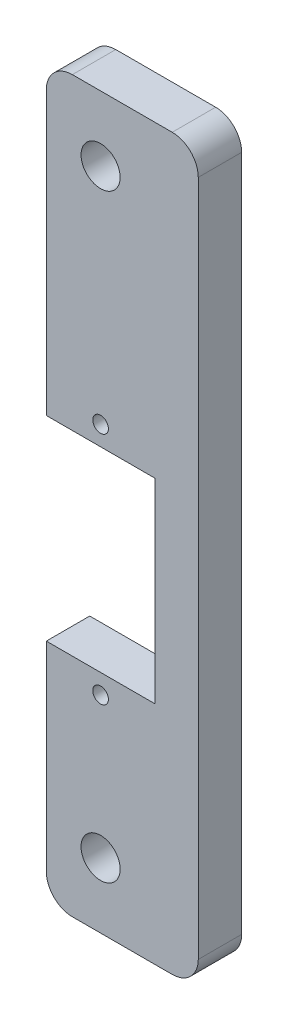
ISO-10303-21;
HEADER;
FILE_DESCRIPTION(('STEP AP214'),'2;1');
FILE_NAME('part.step','',(''),(''),'','','');
FILE_SCHEMA(('AUTOMOTIVE_DESIGN { 1 0 10303 214 1 1 1 1 }'));
ENDSEC;
DATA;
#1=APPLICATION_CONTEXT('core data for automotive mechanical design processes');
#2=APPLICATION_PROTOCOL_DEFINITION('international standard','automotive_design',2000,#1);
#3=PRODUCT_CONTEXT('',#1,'mechanical');
#4=PRODUCT('Part','Part','',(#3));
#5=PRODUCT_RELATED_PRODUCT_CATEGORY('part','',(#4));
#6=PRODUCT_DEFINITION_FORMATION('','',#4);
#7=PRODUCT_DEFINITION_CONTEXT('part definition',#1,'design');
#8=PRODUCT_DEFINITION('design','',#6,#7);
#9=PRODUCT_DEFINITION_SHAPE('','',#8);
#10=(LENGTH_UNIT() NAMED_UNIT(*) SI_UNIT(.MILLI.,.METRE.));
#11=(NAMED_UNIT(*) PLANE_ANGLE_UNIT() SI_UNIT($,.RADIAN.));
#12=(NAMED_UNIT(*) SI_UNIT($,.STERADIAN.) SOLID_ANGLE_UNIT());
#13=UNCERTAINTY_MEASURE_WITH_UNIT(LENGTH_MEASURE(1.E-05),#10,'distance_accuracy_value','');
#14=(GEOMETRIC_REPRESENTATION_CONTEXT(3) GLOBAL_UNCERTAINTY_ASSIGNED_CONTEXT((#13)) GLOBAL_UNIT_ASSIGNED_CONTEXT((#10,
#11,#12)) REPRESENTATION_CONTEXT('',''));
#15=CARTESIAN_POINT('',(0.,0.,0.));
#16=DIRECTION('',(0.,0.,1.));
#17=DIRECTION('',(1.,0.,0.));
#18=AXIS2_PLACEMENT_3D('',#15,#16,#17);
#19=CARTESIAN_POINT('',(-6.25,0.,5.));
#20=DIRECTION('',(-1.,0.,0.));
#21=DIRECTION('',(0.,0.,1.));
#22=AXIS2_PLACEMENT_3D('',#19,#20,#21);
#23=PLANE('',#22);
#24=DIRECTION('',(0.,1.,0.));
#25=VECTOR('',#24,1.);
#26=CARTESIAN_POINT('',(-6.25,0.,5.));
#27=LINE('',#26,#25);
#28=CARTESIAN_POINT('',(-6.25,11.25,5.));
#29=VERTEX_POINT('',#28);
#30=CARTESIAN_POINT('',(-6.25,43.75,5.));
#31=VERTEX_POINT('',#30);
#32=EDGE_CURVE('E127',#29,#31,#27,.T.);
#33=ORIENTED_EDGE('',*,*,#32,.T.);
#34=DIRECTION('',(0.,0.,-1.));
#35=VECTOR('',#34,1.);
#36=CARTESIAN_POINT('',(-6.25,43.75,5.));
#37=LINE('',#36,#35);
#38=CARTESIAN_POINT('',(-6.25,43.75,0.));
#39=VERTEX_POINT('',#38);
#40=EDGE_CURVE('E212',#31,#39,#37,.T.);
#41=ORIENTED_EDGE('',*,*,#40,.T.);
#42=DIRECTION('',(0.,1.,0.));
#43=VECTOR('',#42,1.);
#44=CARTESIAN_POINT('',(-6.25,0.,0.));
#45=LINE('',#44,#43);
#46=CARTESIAN_POINT('',(-6.25,11.25,0.));
#47=VERTEX_POINT('',#46);
#48=EDGE_CURVE('E130',#47,#39,#45,.T.);
#49=ORIENTED_EDGE('',*,*,#48,.F.);
#50=DIRECTION('',(0.,0.,-1.));
#51=VECTOR('',#50,1.);
#52=CARTESIAN_POINT('',(-6.25,11.25,5.));
#53=LINE('',#52,#51);
#54=EDGE_CURVE('E123',#29,#47,#53,.T.);
#55=ORIENTED_EDGE('',*,*,#54,.F.);
#56=EDGE_LOOP('',(#33,#41,#49,#55));
#57=FACE_BOUND('',#56,.T.);
#58=ADVANCED_FACE('F33',(#57),#23,.T.);
#59=CARTESIAN_POINT('',(0.,11.25,5.));
#60=DIRECTION('',(0.,1.,0.));
#61=DIRECTION('',(0.,0.,1.));
#62=AXIS2_PLACEMENT_3D('',#59,#60,#61);
#63=PLANE('',#62);
#64=DIRECTION('',(1.,0.,0.));
#65=VECTOR('',#64,1.);
#66=CARTESIAN_POINT('',(0.,11.25,0.));
#67=LINE('',#66,#65);
#68=CARTESIAN_POINT('',(6.25,11.25,0.));
#69=VERTEX_POINT('',#68);
#70=EDGE_CURVE('E172',#47,#69,#67,.T.);
#71=ORIENTED_EDGE('',*,*,#70,.T.);
#72=DIRECTION('',(0.,0.,-1.));
#73=VECTOR('',#72,1.);
#74=CARTESIAN_POINT('',(6.25,11.25,5.));
#75=LINE('',#74,#73);
#76=CARTESIAN_POINT('',(6.25,11.25,5.));
#77=VERTEX_POINT('',#76);
#78=EDGE_CURVE('E134',#77,#69,#75,.T.);
#79=ORIENTED_EDGE('',*,*,#78,.F.);
#80=DIRECTION('',(1.,0.,0.));
#81=VECTOR('',#80,1.);
#82=CARTESIAN_POINT('',(0.,11.25,5.));
#83=LINE('',#82,#81);
#84=EDGE_CURVE('E137',#29,#77,#83,.T.);
#85=ORIENTED_EDGE('',*,*,#84,.F.);
#86=ORIENTED_EDGE('',*,*,#54,.T.);
#87=EDGE_LOOP('',(#71,#79,#85,#86));
#88=FACE_BOUND('',#87,.T.);
#89=ADVANCED_FACE('F138',(#88),#63,.F.);
#90=CARTESIAN_POINT('',(6.25,0.,5.));
#91=DIRECTION('',(1.,0.,0.));
#92=DIRECTION('',(0.,0.,-1.));
#93=AXIS2_PLACEMENT_3D('',#90,#91,#92);
#94=PLANE('',#93);
#95=DIRECTION('',(0.,-1.,0.));
#96=VECTOR('',#95,1.);
#97=CARTESIAN_POINT('',(6.25,0.,0.));
#98=LINE('',#97,#96);
#99=CARTESIAN_POINT('',(6.25,-11.25,0.));
#100=VERTEX_POINT('',#99);
#101=EDGE_CURVE('E174',#69,#100,#98,.T.);
#102=ORIENTED_EDGE('',*,*,#101,.T.);
#103=DIRECTION('',(0.,0.,-1.));
#104=VECTOR('',#103,1.);
#105=CARTESIAN_POINT('',(6.25,-11.25,5.));
#106=LINE('',#105,#104);
#107=CARTESIAN_POINT('',(6.25,-11.25,5.));
#108=VERTEX_POINT('',#107);
#109=EDGE_CURVE('E189',#108,#100,#106,.T.);
#110=ORIENTED_EDGE('',*,*,#109,.F.);
#111=DIRECTION('',(0.,-1.,0.));
#112=VECTOR('',#111,1.);
#113=CARTESIAN_POINT('',(6.25,0.,5.));
#114=LINE('',#113,#112);
#115=EDGE_CURVE('E141',#77,#108,#114,.T.);
#116=ORIENTED_EDGE('',*,*,#115,.F.);
#117=ORIENTED_EDGE('',*,*,#78,.T.);
#118=EDGE_LOOP('',(#102,#110,#116,#117));
#119=FACE_BOUND('',#118,.T.);
#120=ADVANCED_FACE('F236',(#119),#94,.F.);
#121=CARTESIAN_POINT('',(0.,-11.25,5.));
#122=DIRECTION('',(0.,1.,0.));
#123=DIRECTION('',(0.,0.,1.));
#124=AXIS2_PLACEMENT_3D('',#121,#122,#123);
#125=PLANE('',#124);
#126=DIRECTION('',(1.,0.,0.));
#127=VECTOR('',#126,1.);
#128=CARTESIAN_POINT('',(0.,-11.25,0.));
#129=LINE('',#128,#127);
#130=CARTESIAN_POINT('',(-6.25,-11.25,0.));
#131=VERTEX_POINT('',#130);
#132=EDGE_CURVE('E177',#131,#100,#129,.T.);
#133=ORIENTED_EDGE('',*,*,#132,.F.);
#134=DIRECTION('',(0.,0.,-1.));
#135=VECTOR('',#134,1.);
#136=CARTESIAN_POINT('',(-6.25,-11.25,5.));
#137=LINE('',#136,#135);
#138=CARTESIAN_POINT('',(-6.25,-11.25,5.));
#139=VERTEX_POINT('',#138);
#140=EDGE_CURVE('E170',#139,#131,#137,.T.);
#141=ORIENTED_EDGE('',*,*,#140,.F.);
#142=DIRECTION('',(1.,0.,0.));
#143=VECTOR('',#142,1.);
#144=CARTESIAN_POINT('',(0.,-11.25,5.));
#145=LINE('',#144,#143);
#146=EDGE_CURVE('E157',#139,#108,#145,.T.);
#147=ORIENTED_EDGE('',*,*,#146,.T.);
#148=ORIENTED_EDGE('',*,*,#109,.T.);
#149=EDGE_LOOP('',(#133,#141,#147,#148));
#150=FACE_BOUND('',#149,.T.);
#151=ADVANCED_FACE('F243',(#150),#125,.T.);
#152=CARTESIAN_POINT('',(-6.25,0.,5.));
#153=DIRECTION('',(-1.,0.,0.));
#154=DIRECTION('',(0.,-1.,0.));
#155=AXIS2_PLACEMENT_3D('',#152,#153,#154);
#156=PLANE('',#155);
#157=DIRECTION('',(0.,1.,0.));
#158=VECTOR('',#157,1.);
#159=CARTESIAN_POINT('',(-6.25,0.,0.));
#160=LINE('',#159,#158);
#161=CARTESIAN_POINT('',(-6.25,-34.25,0.));
#162=VERTEX_POINT('',#161);
#163=EDGE_CURVE('E180',#162,#131,#160,.T.);
#164=ORIENTED_EDGE('',*,*,#163,.F.);
#165=DIRECTION('',(0.,0.,-1.));
#166=VECTOR('',#165,1.);
#167=CARTESIAN_POINT('',(-6.25,-34.25,5.));
#168=LINE('',#167,#166);
#169=CARTESIAN_POINT('',(-6.25,-34.25,5.));
#170=VERTEX_POINT('',#169);
#171=EDGE_CURVE('E204',#162,#170,#168,.F.);
#172=ORIENTED_EDGE('',*,*,#171,.T.);
#173=DIRECTION('',(0.,1.,0.));
#174=VECTOR('',#173,1.);
#175=CARTESIAN_POINT('',(-6.25,0.,5.));
#176=LINE('',#175,#174);
#177=EDGE_CURVE('E160',#170,#139,#176,.T.);
#178=ORIENTED_EDGE('',*,*,#177,.T.);
#179=ORIENTED_EDGE('',*,*,#140,.T.);
#180=EDGE_LOOP('',(#164,#172,#178,#179));
#181=FACE_BOUND('',#180,.T.);
#182=ADVANCED_FACE('F246',(#181),#156,.T.);
#183=CARTESIAN_POINT('',(0.,-37.25,5.));
#184=DIRECTION('',(0.,1.,0.));
#185=DIRECTION('',(0.,0.,1.));
#186=AXIS2_PLACEMENT_3D('',#183,#184,#185);
#187=PLANE('',#186);
#188=DIRECTION('',(1.,0.,0.));
#189=VECTOR('',#188,1.);
#190=CARTESIAN_POINT('',(0.,-37.25,5.));
#191=LINE('',#190,#189);
#192=CARTESIAN_POINT('',(-3.25,-37.25,5.));
#193=VERTEX_POINT('',#192);
#194=CARTESIAN_POINT('',(8.25000000000001,-37.25,5.));
#195=VERTEX_POINT('',#194);
#196=EDGE_CURVE('E162',#193,#195,#191,.T.);
#197=ORIENTED_EDGE('',*,*,#196,.F.);
#198=DIRECTION('',(0.,0.,-1.));
#199=VECTOR('',#198,1.);
#200=CARTESIAN_POINT('',(-3.25,-37.25,0.));
#201=LINE('',#200,#199);
#202=CARTESIAN_POINT('',(-3.25,-37.25,0.));
#203=VERTEX_POINT('',#202);
#204=EDGE_CURVE('E193',#193,#203,#201,.T.);
#205=ORIENTED_EDGE('',*,*,#204,.T.);
#206=DIRECTION('',(1.,0.,0.));
#207=VECTOR('',#206,1.);
#208=CARTESIAN_POINT('',(0.,-37.25,0.));
#209=LINE('',#208,#207);
#210=CARTESIAN_POINT('',(8.25000000000001,-37.25,0.));
#211=VERTEX_POINT('',#210);
#212=EDGE_CURVE('E182',#203,#211,#209,.T.);
#213=ORIENTED_EDGE('',*,*,#212,.T.);
#214=DIRECTION('',(0.,0.,-1.));
#215=VECTOR('',#214,1.);
#216=CARTESIAN_POINT('',(8.25000000000001,-37.25,5.));
#217=LINE('',#216,#215);
#218=EDGE_CURVE('E133',#211,#195,#217,.F.);
#219=ORIENTED_EDGE('',*,*,#218,.T.);
#220=EDGE_LOOP('',(#197,#205,#213,#219));
#221=FACE_BOUND('',#220,.T.);
#222=ADVANCED_FACE('F253',(#221),#187,.F.);
#223=CARTESIAN_POINT('',(11.25,0.,5.));
#224=DIRECTION('',(1.,0.,0.));
#225=DIRECTION('',(0.,0.,-1.));
#226=AXIS2_PLACEMENT_3D('',#223,#224,#225);
#227=PLANE('',#226);
#228=DIRECTION('',(0.,-1.,0.));
#229=VECTOR('',#228,1.);
#230=CARTESIAN_POINT('',(11.25,0.,0.));
#231=LINE('',#230,#229);
#232=CARTESIAN_POINT('',(11.25,43.75,0.));
#233=VERTEX_POINT('',#232);
#234=CARTESIAN_POINT('',(11.25,-34.25,0.));
#235=VERTEX_POINT('',#234);
#236=EDGE_CURVE('E150',#233,#235,#231,.T.);
#237=ORIENTED_EDGE('',*,*,#236,.F.);
#238=DIRECTION('',(0.,0.,-1.));
#239=VECTOR('',#238,1.);
#240=CARTESIAN_POINT('',(11.25,43.75,5.));
#241=LINE('',#240,#239);
#242=CARTESIAN_POINT('',(11.25,43.75,5.));
#243=VERTEX_POINT('',#242);
#244=EDGE_CURVE('E11',#233,#243,#241,.F.);
#245=ORIENTED_EDGE('',*,*,#244,.T.);
#246=DIRECTION('',(0.,-1.,0.));
#247=VECTOR('',#246,1.);
#248=CARTESIAN_POINT('',(11.25,0.,5.));
#249=LINE('',#248,#247);
#250=CARTESIAN_POINT('',(11.25,-34.25,5.));
#251=VERTEX_POINT('',#250);
#252=EDGE_CURVE('E165',#243,#251,#249,.T.);
#253=ORIENTED_EDGE('',*,*,#252,.T.);
#254=DIRECTION('',(0.,0.,-1.));
#255=VECTOR('',#254,1.);
#256=CARTESIAN_POINT('',(11.25,-34.25,0.));
#257=LINE('',#256,#255);
#258=EDGE_CURVE('E41',#251,#235,#257,.T.);
#259=ORIENTED_EDGE('',*,*,#258,.T.);
#260=EDGE_LOOP('',(#237,#245,#253,#259));
#261=FACE_BOUND('',#260,.T.);
#262=ADVANCED_FACE('F221',(#261),#227,.T.);
#263=CARTESIAN_POINT('',(0.,46.75,5.));
#264=DIRECTION('',(0.,1.,0.));
#265=DIRECTION('',(0.,0.,1.));
#266=AXIS2_PLACEMENT_3D('',#263,#264,#265);
#267=PLANE('',#266);
#268=DIRECTION('',(1.,0.,0.));
#269=VECTOR('',#268,1.);
#270=CARTESIAN_POINT('',(0.,46.75,0.));
#271=LINE('',#270,#269);
#272=CARTESIAN_POINT('',(-3.25,46.75,0.));
#273=VERTEX_POINT('',#272);
#274=CARTESIAN_POINT('',(8.25000000000001,46.75,0.));
#275=VERTEX_POINT('',#274);
#276=EDGE_CURVE('E147',#273,#275,#271,.T.);
#277=ORIENTED_EDGE('',*,*,#276,.F.);
#278=DIRECTION('',(0.,0.,-1.));
#279=VECTOR('',#278,1.);
#280=CARTESIAN_POINT('',(-3.25,46.75,5.));
#281=LINE('',#280,#279);
#282=CARTESIAN_POINT('',(-3.25,46.75,5.));
#283=VERTEX_POINT('',#282);
#284=EDGE_CURVE('E55',#273,#283,#281,.F.);
#285=ORIENTED_EDGE('',*,*,#284,.T.);
#286=DIRECTION('',(1.,0.,0.));
#287=VECTOR('',#286,1.);
#288=CARTESIAN_POINT('',(0.,46.75,5.));
#289=LINE('',#288,#287);
#290=CARTESIAN_POINT('',(8.25000000000001,46.75,5.));
#291=VERTEX_POINT('',#290);
#292=EDGE_CURVE('E168',#283,#291,#289,.T.);
#293=ORIENTED_EDGE('',*,*,#292,.T.);
#294=DIRECTION('',(0.,0.,-1.));
#295=VECTOR('',#294,1.);
#296=CARTESIAN_POINT('',(8.25000000000001,46.75,5.));
#297=LINE('',#296,#295);
#298=EDGE_CURVE('E214',#291,#275,#297,.T.);
#299=ORIENTED_EDGE('',*,*,#298,.T.);
#300=EDGE_LOOP('',(#277,#285,#293,#299));
#301=FACE_BOUND('',#300,.T.);
#302=ADVANCED_FACE('F231',(#301),#267,.T.);
#303=CARTESIAN_POINT('',(0.,0.,5.));
#304=DIRECTION('',(0.,0.,1.));
#305=DIRECTION('',(1.,0.,0.));
#306=AXIS2_PLACEMENT_3D('',#303,#304,#305);
#307=PLANE('',#306);
#308=CARTESIAN_POINT('',(0.,13.5,5.));
#309=DIRECTION('',(0.,0.,-1.));
#310=DIRECTION('',(-1.,0.,0.));
#311=AXIS2_PLACEMENT_3D('',#308,#309,#310);
#312=CIRCLE('',#311,0.899999999999999);
#313=CARTESIAN_POINT('',(-0.9,13.5,5.));
#314=VERTEX_POINT('',#313);
#315=EDGE_CURVE('E429',#314,#314,#312,.T.);
#316=ORIENTED_EDGE('',*,*,#315,.T.);
#317=EDGE_LOOP('',(#316));
#318=FACE_BOUND('',#317,.T.);
#319=CARTESIAN_POINT('',(0.,-13.5,5.));
#320=DIRECTION('',(0.,0.,-1.));
#321=DIRECTION('',(-1.,0.,0.));
#322=AXIS2_PLACEMENT_3D('',#319,#320,#321);
#323=CIRCLE('',#322,0.899999999999999);
#324=CARTESIAN_POINT('',(-0.899999999999998,-13.5,5.));
#325=VERTEX_POINT('',#324);
#326=EDGE_CURVE('E423',#325,#325,#323,.T.);
#327=ORIENTED_EDGE('',*,*,#326,.T.);
#328=EDGE_LOOP('',(#327));
#329=FACE_BOUND('',#328,.T.);
#330=CARTESIAN_POINT('',(0.,39.25,5.));
#331=DIRECTION('',(0.,0.,-1.));
#332=DIRECTION('',(-1.,0.,0.));
#333=AXIS2_PLACEMENT_3D('',#330,#331,#332);
#334=CIRCLE('',#333,2.25);
#335=CARTESIAN_POINT('',(-2.25,39.25,5.));
#336=VERTEX_POINT('',#335);
#337=EDGE_CURVE('E416',#336,#336,#334,.T.);
#338=ORIENTED_EDGE('',*,*,#337,.T.);
#339=EDGE_LOOP('',(#338));
#340=FACE_BOUND('',#339,.T.);
#341=CARTESIAN_POINT('',(0.,-29.75,5.));
#342=DIRECTION('',(0.,0.,-1.));
#343=DIRECTION('',(-1.,0.,0.));
#344=AXIS2_PLACEMENT_3D('',#341,#342,#343);
#345=CIRCLE('',#344,2.25);
#346=CARTESIAN_POINT('',(-2.25,-29.75,5.));
#347=VERTEX_POINT('',#346);
#348=EDGE_CURVE('E153',#347,#347,#345,.T.);
#349=ORIENTED_EDGE('',*,*,#348,.T.);
#350=EDGE_LOOP('',(#349));
#351=FACE_BOUND('',#350,.T.);
#352=ORIENTED_EDGE('',*,*,#177,.F.);
#353=CARTESIAN_POINT('',(-3.25,-34.25,5.));
#354=DIRECTION('',(0.,0.,1.));
#355=DIRECTION('',(1.,0.,0.));
#356=AXIS2_PLACEMENT_3D('',#353,#354,#355);
#357=CIRCLE('',#356,3.);
#358=EDGE_CURVE('E210',#170,#193,#357,.T.);
#359=ORIENTED_EDGE('',*,*,#358,.T.);
#360=ORIENTED_EDGE('',*,*,#196,.T.);
#361=CARTESIAN_POINT('',(8.25000000000001,-34.25,5.));
#362=DIRECTION('',(0.,0.,1.));
#363=DIRECTION('',(1.,0.,0.));
#364=AXIS2_PLACEMENT_3D('',#361,#362,#363);
#365=CIRCLE('',#364,3.);
#366=EDGE_CURVE('E206',#195,#251,#365,.T.);
#367=ORIENTED_EDGE('',*,*,#366,.T.);
#368=ORIENTED_EDGE('',*,*,#252,.F.);
#369=CARTESIAN_POINT('',(8.25000000000001,43.75,5.));
#370=DIRECTION('',(0.,0.,1.));
#371=DIRECTION('',(1.,0.,0.));
#372=AXIS2_PLACEMENT_3D('',#369,#370,#371);
#373=CIRCLE('',#372,3.);
#374=EDGE_CURVE('E48',#243,#291,#373,.T.);
#375=ORIENTED_EDGE('',*,*,#374,.T.);
#376=ORIENTED_EDGE('',*,*,#292,.F.);
#377=CARTESIAN_POINT('',(-3.25,43.75,5.));
#378=DIRECTION('',(0.,0.,1.));
#379=DIRECTION('',(1.,0.,0.));
#380=AXIS2_PLACEMENT_3D('',#377,#378,#379);
#381=CIRCLE('',#380,3.);
#382=EDGE_CURVE('E146',#283,#31,#381,.T.);
#383=ORIENTED_EDGE('',*,*,#382,.T.);
#384=ORIENTED_EDGE('',*,*,#32,.F.);
#385=ORIENTED_EDGE('',*,*,#84,.T.);
#386=ORIENTED_EDGE('',*,*,#115,.T.);
#387=ORIENTED_EDGE('',*,*,#146,.F.);
#388=EDGE_LOOP('',(#352,#359,#360,#367,#368,#375,#376,#383,#384,#385,#386,#387));
#389=FACE_BOUND('',#388,.T.);
#390=ADVANCED_FACE('F144',(#318,#329,#340,#351,#389),#307,.T.);
#391=CARTESIAN_POINT('',(0.,0.,0.));
#392=DIRECTION('',(0.,0.,1.));
#393=DIRECTION('',(1.,0.,0.));
#394=AXIS2_PLACEMENT_3D('',#391,#392,#393);
#395=PLANE('',#394);
#396=CARTESIAN_POINT('',(0.,13.5,0.));
#397=DIRECTION('',(0.,0.,-1.));
#398=DIRECTION('',(-1.,0.,0.));
#399=AXIS2_PLACEMENT_3D('',#396,#397,#398);
#400=CIRCLE('',#399,0.899999999999999);
#401=CARTESIAN_POINT('',(-0.9,13.5,0.));
#402=VERTEX_POINT('',#401);
#403=EDGE_CURVE('E432',#402,#402,#400,.T.);
#404=ORIENTED_EDGE('',*,*,#403,.F.);
#405=EDGE_LOOP('',(#404));
#406=FACE_BOUND('',#405,.T.);
#407=CARTESIAN_POINT('',(0.,-13.5,0.));
#408=DIRECTION('',(0.,0.,-1.));
#409=DIRECTION('',(-1.,0.,0.));
#410=AXIS2_PLACEMENT_3D('',#407,#408,#409);
#411=CIRCLE('',#410,0.899999999999999);
#412=CARTESIAN_POINT('',(-0.899999999999999,-13.5,0.));
#413=VERTEX_POINT('',#412);
#414=EDGE_CURVE('E426',#413,#413,#411,.T.);
#415=ORIENTED_EDGE('',*,*,#414,.F.);
#416=EDGE_LOOP('',(#415));
#417=FACE_BOUND('',#416,.T.);
#418=CARTESIAN_POINT('',(0.,39.25,0.));
#419=DIRECTION('',(0.,0.,-1.));
#420=DIRECTION('',(-1.,0.,0.));
#421=AXIS2_PLACEMENT_3D('',#418,#419,#420);
#422=CIRCLE('',#421,2.25);
#423=CARTESIAN_POINT('',(-2.25,39.25,0.));
#424=VERTEX_POINT('',#423);
#425=EDGE_CURVE('E418',#424,#424,#422,.T.);
#426=ORIENTED_EDGE('',*,*,#425,.F.);
#427=EDGE_LOOP('',(#426));
#428=FACE_BOUND('',#427,.T.);
#429=CARTESIAN_POINT('',(0.,-29.75,0.));
#430=DIRECTION('',(0.,0.,-1.));
#431=DIRECTION('',(-1.,0.,0.));
#432=AXIS2_PLACEMENT_3D('',#429,#430,#431);
#433=CIRCLE('',#432,2.25);
#434=CARTESIAN_POINT('',(-2.25,-29.75,0.));
#435=VERTEX_POINT('',#434);
#436=EDGE_CURVE('E414',#435,#435,#433,.T.);
#437=ORIENTED_EDGE('',*,*,#436,.F.);
#438=EDGE_LOOP('',(#437));
#439=FACE_BOUND('',#438,.T.);
#440=ORIENTED_EDGE('',*,*,#212,.F.);
#441=CARTESIAN_POINT('',(-3.25,-34.25,0.));
#442=DIRECTION('',(0.,0.,1.));
#443=DIRECTION('',(1.,0.,0.));
#444=AXIS2_PLACEMENT_3D('',#441,#442,#443);
#445=CIRCLE('',#444,3.);
#446=EDGE_CURVE('E202',#203,#162,#445,.F.);
#447=ORIENTED_EDGE('',*,*,#446,.T.);
#448=ORIENTED_EDGE('',*,*,#163,.T.);
#449=ORIENTED_EDGE('',*,*,#132,.T.);
#450=ORIENTED_EDGE('',*,*,#101,.F.);
#451=ORIENTED_EDGE('',*,*,#70,.F.);
#452=ORIENTED_EDGE('',*,*,#48,.T.);
#453=CARTESIAN_POINT('',(-3.25,43.75,0.));
#454=DIRECTION('',(0.,0.,1.));
#455=DIRECTION('',(1.,0.,0.));
#456=AXIS2_PLACEMENT_3D('',#453,#454,#455);
#457=CIRCLE('',#456,3.);
#458=EDGE_CURVE('E200',#39,#273,#457,.F.);
#459=ORIENTED_EDGE('',*,*,#458,.T.);
#460=ORIENTED_EDGE('',*,*,#276,.T.);
#461=CARTESIAN_POINT('',(8.25000000000001,43.75,0.));
#462=DIRECTION('',(0.,0.,1.));
#463=DIRECTION('',(1.,0.,0.));
#464=AXIS2_PLACEMENT_3D('',#461,#462,#463);
#465=CIRCLE('',#464,3.);
#466=EDGE_CURVE('E198',#275,#233,#465,.F.);
#467=ORIENTED_EDGE('',*,*,#466,.T.);
#468=ORIENTED_EDGE('',*,*,#236,.T.);
#469=CARTESIAN_POINT('',(8.25000000000001,-34.25,0.));
#470=DIRECTION('',(0.,0.,1.));
#471=DIRECTION('',(1.,0.,0.));
#472=AXIS2_PLACEMENT_3D('',#469,#470,#471);
#473=CIRCLE('',#472,3.);
#474=EDGE_CURVE('E196',#235,#211,#473,.F.);
#475=ORIENTED_EDGE('',*,*,#474,.T.);
#476=EDGE_LOOP('',(#440,#447,#448,#449,#450,#451,#452,#459,#460,#467,#468,#475));
#477=FACE_BOUND('',#476,.T.);
#478=ADVANCED_FACE('F227',(#406,#417,#428,#439,#477),#395,.F.);
#479=CARTESIAN_POINT('',(0.,-29.75,0.));
#480=DIRECTION('',(0.,0.,-1.));
#481=DIRECTION('',(-1.,0.,0.));
#482=AXIS2_PLACEMENT_3D('',#479,#480,#481);
#483=CYLINDRICAL_SURFACE('',#482,2.25);
#484=ORIENTED_EDGE('',*,*,#348,.F.);
#485=EDGE_LOOP('',(#484));
#486=FACE_BOUND('',#485,.T.);
#487=ORIENTED_EDGE('',*,*,#436,.T.);
#488=EDGE_LOOP('',(#487));
#489=FACE_BOUND('',#488,.T.);
#490=ADVANCED_FACE('F310',(#486,#489),#483,.F.);
#491=CARTESIAN_POINT('',(0.,39.25,0.));
#492=DIRECTION('',(0.,0.,-1.));
#493=DIRECTION('',(-1.,0.,0.));
#494=AXIS2_PLACEMENT_3D('',#491,#492,#493);
#495=CYLINDRICAL_SURFACE('',#494,2.25);
#496=ORIENTED_EDGE('',*,*,#337,.F.);
#497=EDGE_LOOP('',(#496));
#498=FACE_BOUND('',#497,.T.);
#499=ORIENTED_EDGE('',*,*,#425,.T.);
#500=EDGE_LOOP('',(#499));
#501=FACE_BOUND('',#500,.T.);
#502=ADVANCED_FACE('F274',(#498,#501),#495,.F.);
#503=CARTESIAN_POINT('',(-3.25,-34.25,5.));
#504=DIRECTION('',(0.,0.,1.));
#505=DIRECTION('',(1.,0.,0.));
#506=AXIS2_PLACEMENT_3D('',#503,#504,#505);
#507=CYLINDRICAL_SURFACE('',#506,3.);
#508=ORIENTED_EDGE('',*,*,#358,.F.);
#509=ORIENTED_EDGE('',*,*,#171,.F.);
#510=ORIENTED_EDGE('',*,*,#446,.F.);
#511=ORIENTED_EDGE('',*,*,#204,.F.);
#512=EDGE_LOOP('',(#508,#509,#510,#511));
#513=FACE_BOUND('',#512,.T.);
#514=ADVANCED_FACE('F249',(#513),#507,.T.);
#515=CARTESIAN_POINT('',(-3.25,43.75,5.));
#516=DIRECTION('',(0.,0.,-1.));
#517=DIRECTION('',(-1.,0.,0.));
#518=AXIS2_PLACEMENT_3D('',#515,#516,#517);
#519=CYLINDRICAL_SURFACE('',#518,3.);
#520=ORIENTED_EDGE('',*,*,#382,.F.);
#521=ORIENTED_EDGE('',*,*,#284,.F.);
#522=ORIENTED_EDGE('',*,*,#458,.F.);
#523=ORIENTED_EDGE('',*,*,#40,.F.);
#524=EDGE_LOOP('',(#520,#521,#522,#523));
#525=FACE_BOUND('',#524,.T.);
#526=ADVANCED_FACE('F233',(#525),#519,.T.);
#527=CARTESIAN_POINT('',(8.25000000000001,43.75,5.));
#528=DIRECTION('',(0.,0.,-1.));
#529=DIRECTION('',(-1.,0.,0.));
#530=AXIS2_PLACEMENT_3D('',#527,#528,#529);
#531=CYLINDRICAL_SURFACE('',#530,3.);
#532=ORIENTED_EDGE('',*,*,#374,.F.);
#533=ORIENTED_EDGE('',*,*,#244,.F.);
#534=ORIENTED_EDGE('',*,*,#466,.F.);
#535=ORIENTED_EDGE('',*,*,#298,.F.);
#536=EDGE_LOOP('',(#532,#533,#534,#535));
#537=FACE_BOUND('',#536,.T.);
#538=ADVANCED_FACE('F230',(#537),#531,.T.);
#539=CARTESIAN_POINT('',(8.25000000000001,-34.25,5.));
#540=DIRECTION('',(0.,0.,1.));
#541=DIRECTION('',(1.,0.,0.));
#542=AXIS2_PLACEMENT_3D('',#539,#540,#541);
#543=CYLINDRICAL_SURFACE('',#542,3.);
#544=ORIENTED_EDGE('',*,*,#366,.F.);
#545=ORIENTED_EDGE('',*,*,#218,.F.);
#546=ORIENTED_EDGE('',*,*,#474,.F.);
#547=ORIENTED_EDGE('',*,*,#258,.F.);
#548=EDGE_LOOP('',(#544,#545,#546,#547));
#549=FACE_BOUND('',#548,.T.);
#550=ADVANCED_FACE('F35',(#549),#543,.T.);
#551=CARTESIAN_POINT('',(0.,-13.5,0.));
#552=DIRECTION('',(0.,0.,-1.));
#553=DIRECTION('',(-1.,0.,0.));
#554=AXIS2_PLACEMENT_3D('',#551,#552,#553);
#555=CYLINDRICAL_SURFACE('',#554,0.899999999999999);
#556=ORIENTED_EDGE('',*,*,#326,.F.);
#557=EDGE_LOOP('',(#556));
#558=FACE_BOUND('',#557,.T.);
#559=ORIENTED_EDGE('',*,*,#414,.T.);
#560=EDGE_LOOP('',(#559));
#561=FACE_BOUND('',#560,.T.);
#562=ADVANCED_FACE('F256',(#558,#561),#555,.F.);
#563=CARTESIAN_POINT('',(0.,13.5,0.));
#564=DIRECTION('',(0.,0.,-1.));
#565=DIRECTION('',(-1.,0.,0.));
#566=AXIS2_PLACEMENT_3D('',#563,#564,#565);
#567=CYLINDRICAL_SURFACE('',#566,0.899999999999999);
#568=ORIENTED_EDGE('',*,*,#315,.F.);
#569=EDGE_LOOP('',(#568));
#570=FACE_BOUND('',#569,.T.);
#571=ORIENTED_EDGE('',*,*,#403,.T.);
#572=EDGE_LOOP('',(#571));
#573=FACE_BOUND('',#572,.T.);
#574=ADVANCED_FACE('F261',(#570,#573),#567,.F.);
#575=CLOSED_SHELL('',(#58,#89,#120,#151,#182,#222,#262,#302,#390,#478,#490,#502,#514,#526,#538,
#550,#562,#574));
#576=MANIFOLD_SOLID_BREP('B2',#575);
#577=ADVANCED_BREP_SHAPE_REPRESENTATION('',(#18,#576),#14);
#578=SHAPE_DEFINITION_REPRESENTATION(#9,#577);
ENDSEC;
END-ISO-10303-21;
